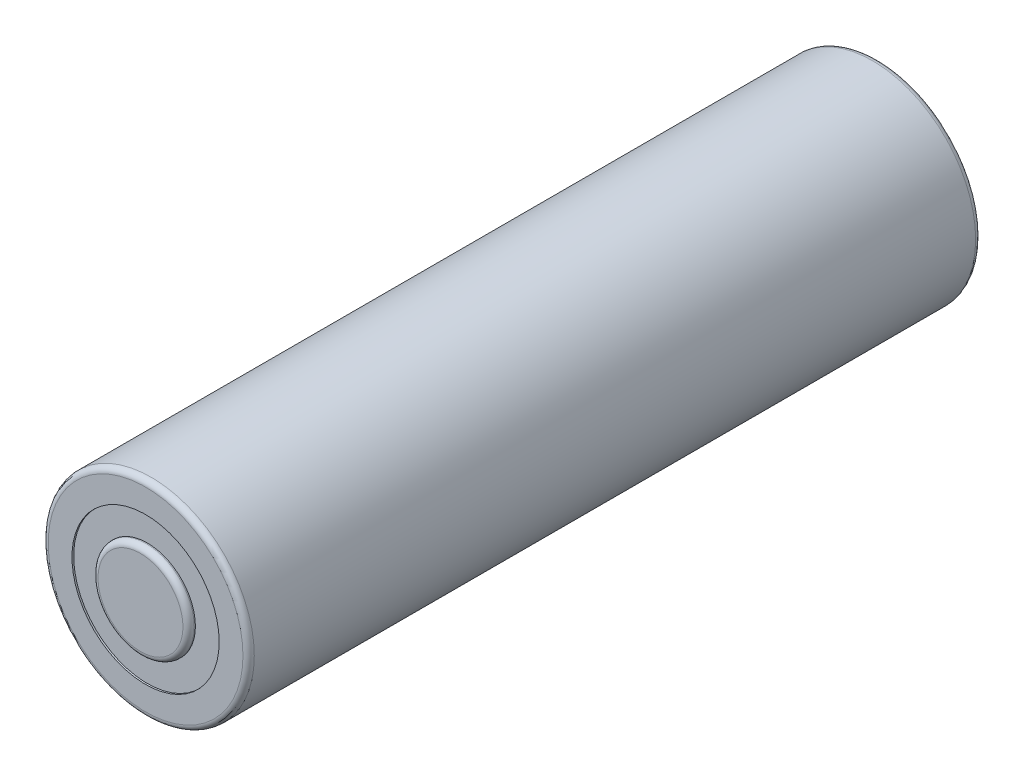
ISO-10303-21;
HEADER;
FILE_DESCRIPTION(('STEP AP214'),'2;1');
FILE_NAME('part.step','',(''),(''),'','','');
FILE_SCHEMA(('AUTOMOTIVE_DESIGN { 1 0 10303 214 1 1 1 1 }'));
ENDSEC;
DATA;
#1=APPLICATION_CONTEXT('core data for automotive mechanical design processes');
#2=APPLICATION_PROTOCOL_DEFINITION('international standard','automotive_design',2000,#1);
#3=PRODUCT_CONTEXT('',#1,'mechanical');
#4=PRODUCT('Part','Part','',(#3));
#5=PRODUCT_RELATED_PRODUCT_CATEGORY('part','',(#4));
#6=PRODUCT_DEFINITION_FORMATION('','',#4);
#7=PRODUCT_DEFINITION_CONTEXT('part definition',#1,'design');
#8=PRODUCT_DEFINITION('design','',#6,#7);
#9=PRODUCT_DEFINITION_SHAPE('','',#8);
#10=(LENGTH_UNIT() NAMED_UNIT(*) SI_UNIT(.MILLI.,.METRE.));
#11=(NAMED_UNIT(*) PLANE_ANGLE_UNIT() SI_UNIT($,.RADIAN.));
#12=(NAMED_UNIT(*) SI_UNIT($,.STERADIAN.) SOLID_ANGLE_UNIT());
#13=UNCERTAINTY_MEASURE_WITH_UNIT(LENGTH_MEASURE(1.E-05),#10,'distance_accuracy_value','');
#14=(GEOMETRIC_REPRESENTATION_CONTEXT(3) GLOBAL_UNCERTAINTY_ASSIGNED_CONTEXT((#13)) GLOBAL_UNIT_ASSIGNED_CONTEXT((#10,
#11,#12)) REPRESENTATION_CONTEXT('',''));
#15=CARTESIAN_POINT('',(0.,0.,0.));
#16=DIRECTION('',(0.,0.,1.));
#17=DIRECTION('',(1.,0.,0.));
#18=AXIS2_PLACEMENT_3D('',#15,#16,#17);
#19=CARTESIAN_POINT('',(-28.8743604465354,15.271996124031,64.7));
#20=DIRECTION('',(0.,0.,-1.));
#21=DIRECTION('',(-1.,0.,0.));
#22=AXIS2_PLACEMENT_3D('',#19,#20,#21);
#23=CYLINDRICAL_SURFACE('',#22,9.1);
#24=CARTESIAN_POINT('',(-28.8743604465354,15.271996124031,64.2));
#25=DIRECTION('',(0.,0.,1.));
#26=DIRECTION('',(1.,0.,0.));
#27=AXIS2_PLACEMENT_3D('',#24,#25,#26);
#28=CIRCLE('',#27,9.1);
#29=CARTESIAN_POINT('',(-19.7743604465354,15.271996124031,64.2));
#30=VERTEX_POINT('',#29);
#31=EDGE_CURVE('E45',#30,#30,#28,.F.);
#32=ORIENTED_EDGE('',*,*,#31,.T.);
#33=EDGE_LOOP('',(#32));
#34=FACE_BOUND('',#33,.T.);
#35=CARTESIAN_POINT('',(-28.8743604465354,15.271996124031,0.5));
#36=DIRECTION('',(0.,0.,1.));
#37=DIRECTION('',(1.,0.,0.));
#38=AXIS2_PLACEMENT_3D('',#35,#36,#37);
#39=CIRCLE('',#38,9.1);
#40=CARTESIAN_POINT('',(-19.7743604465354,15.271996124031,0.5));
#41=VERTEX_POINT('',#40);
#42=EDGE_CURVE('E57',#41,#41,#39,.T.);
#43=ORIENTED_EDGE('',*,*,#42,.T.);
#44=EDGE_LOOP('',(#43));
#45=FACE_BOUND('',#44,.T.);
#46=ADVANCED_FACE('F34',(#34,#45),#23,.T.);
#47=CARTESIAN_POINT('',(-28.8743604465354,15.271996124031,64.7));
#48=DIRECTION('',(0.,0.,1.));
#49=DIRECTION('',(1.,0.,0.));
#50=AXIS2_PLACEMENT_3D('',#47,#48,#49);
#51=PLANE('',#50);
#52=CARTESIAN_POINT('',(-28.8743604465354,15.271996124031,64.7));
#53=DIRECTION('',(0.,0.,1.));
#54=DIRECTION('',(1.,0.,0.));
#55=AXIS2_PLACEMENT_3D('',#52,#53,#54);
#56=CIRCLE('',#55,6.5);
#57=CARTESIAN_POINT('',(-22.3743604465354,15.271996124031,64.7));
#58=VERTEX_POINT('',#57);
#59=EDGE_CURVE('E64',#58,#58,#56,.T.);
#60=ORIENTED_EDGE('',*,*,#59,.F.);
#61=EDGE_LOOP('',(#60));
#62=FACE_BOUND('',#61,.T.);
#63=CARTESIAN_POINT('',(-28.8743604465354,15.271996124031,64.7));
#64=DIRECTION('',(0.,0.,1.));
#65=DIRECTION('',(1.,0.,0.));
#66=AXIS2_PLACEMENT_3D('',#63,#64,#65);
#67=CIRCLE('',#66,8.6);
#68=CARTESIAN_POINT('',(-20.2743604465354,15.271996124031,64.7));
#69=VERTEX_POINT('',#68);
#70=EDGE_CURVE('E49',#69,#69,#67,.T.);
#71=ORIENTED_EDGE('',*,*,#70,.T.);
#72=EDGE_LOOP('',(#71));
#73=FACE_BOUND('',#72,.T.);
#74=ADVANCED_FACE('F93',(#62,#73),#51,.T.);
#75=CARTESIAN_POINT('',(-28.8743604465354,15.271996124031,0.));
#76=DIRECTION('',(0.,0.,1.));
#77=DIRECTION('',(1.,0.,0.));
#78=AXIS2_PLACEMENT_3D('',#75,#76,#77);
#79=PLANE('',#78);
#80=CARTESIAN_POINT('',(-28.8743604465354,15.271996124031,0.));
#81=DIRECTION('',(0.,0.,-1.));
#82=DIRECTION('',(-1.,0.,0.));
#83=AXIS2_PLACEMENT_3D('',#80,#81,#82);
#84=CIRCLE('',#83,6.5);
#85=CARTESIAN_POINT('',(-35.3743604465354,15.271996124031,0.));
#86=VERTEX_POINT('',#85);
#87=EDGE_CURVE('E61',#86,#86,#84,.T.);
#88=ORIENTED_EDGE('',*,*,#87,.F.);
#89=EDGE_LOOP('',(#88));
#90=FACE_BOUND('',#89,.T.);
#91=CARTESIAN_POINT('',(-28.8743604465354,15.271996124031,0.));
#92=DIRECTION('',(0.,0.,1.));
#93=DIRECTION('',(1.,0.,0.));
#94=AXIS2_PLACEMENT_3D('',#91,#92,#93);
#95=CIRCLE('',#94,8.6);
#96=CARTESIAN_POINT('',(-20.2743604465354,15.271996124031,0.));
#97=VERTEX_POINT('',#96);
#98=EDGE_CURVE('E54',#97,#97,#95,.F.);
#99=ORIENTED_EDGE('',*,*,#98,.T.);
#100=EDGE_LOOP('',(#99));
#101=FACE_BOUND('',#100,.T.);
#102=ADVANCED_FACE('F99',(#90,#101),#79,.F.);
#103=CARTESIAN_POINT('',(-28.8743604465354,15.271996124031,0.5));
#104=DIRECTION('',(0.,0.,1.));
#105=DIRECTION('',(1.,0.,0.));
#106=AXIS2_PLACEMENT_3D('',#103,#104,#105);
#107=TOROIDAL_SURFACE('',#106,8.6,0.5);
#108=ORIENTED_EDGE('',*,*,#98,.F.);
#109=EDGE_LOOP('',(#108));
#110=FACE_BOUND('',#109,.T.);
#111=ORIENTED_EDGE('',*,*,#42,.F.);
#112=EDGE_LOOP('',(#111));
#113=FACE_BOUND('',#112,.T.);
#114=ADVANCED_FACE('F105',(#110,#113),#107,.T.);
#115=CARTESIAN_POINT('',(-28.8743604465354,15.271996124031,64.2));
#116=DIRECTION('',(0.,0.,1.));
#117=DIRECTION('',(1.,0.,0.));
#118=AXIS2_PLACEMENT_3D('',#115,#116,#117);
#119=TOROIDAL_SURFACE('',#118,8.6,0.5);
#120=ORIENTED_EDGE('',*,*,#31,.F.);
#121=EDGE_LOOP('',(#120));
#122=FACE_BOUND('',#121,.T.);
#123=ORIENTED_EDGE('',*,*,#70,.F.);
#124=EDGE_LOOP('',(#123));
#125=FACE_BOUND('',#124,.T.);
#126=ADVANCED_FACE('F107',(#122,#125),#119,.T.);
#127=CARTESIAN_POINT('',(-28.8743604465354,15.271996124031,0.35));
#128=DIRECTION('',(0.,0.,-1.));
#129=DIRECTION('',(-1.,0.,0.));
#130=AXIS2_PLACEMENT_3D('',#127,#128,#129);
#131=CYLINDRICAL_SURFACE('',#130,6.5);
#132=CARTESIAN_POINT('',(-28.8743604465354,15.271996124031,0.35));
#133=DIRECTION('',(0.,0.,-1.));
#134=DIRECTION('',(-1.,0.,0.));
#135=AXIS2_PLACEMENT_3D('',#132,#133,#134);
#136=CIRCLE('',#135,6.5);
#137=CARTESIAN_POINT('',(-35.3743604465354,15.271996124031,0.35));
#138=VERTEX_POINT('',#137);
#139=EDGE_CURVE('E60',#138,#138,#136,.T.);
#140=ORIENTED_EDGE('',*,*,#139,.F.);
#141=EDGE_LOOP('',(#140));
#142=FACE_BOUND('',#141,.T.);
#143=ORIENTED_EDGE('',*,*,#87,.T.);
#144=EDGE_LOOP('',(#143));
#145=FACE_BOUND('',#144,.T.);
#146=ADVANCED_FACE('F110',(#142,#145),#131,.F.);
#147=CARTESIAN_POINT('',(-28.8743604465354,15.271996124031,0.35));
#148=DIRECTION('',(0.,0.,-1.));
#149=DIRECTION('',(-1.,0.,0.));
#150=AXIS2_PLACEMENT_3D('',#147,#148,#149);
#151=PLANE('',#150);
#152=ORIENTED_EDGE('',*,*,#139,.T.);
#153=EDGE_LOOP('',(#152));
#154=FACE_BOUND('',#153,.T.);
#155=ADVANCED_FACE('F89',(#154),#151,.T.);
#156=CARTESIAN_POINT('',(-28.8743604465354,15.271996124031,64.35));
#157=DIRECTION('',(0.,0.,1.));
#158=DIRECTION('',(1.,0.,0.));
#159=AXIS2_PLACEMENT_3D('',#156,#157,#158);
#160=CYLINDRICAL_SURFACE('',#159,6.5);
#161=CARTESIAN_POINT('',(-28.8743604465354,15.271996124031,64.55));
#162=DIRECTION('',(0.,0.,1.));
#163=DIRECTION('',(1.,0.,0.));
#164=AXIS2_PLACEMENT_3D('',#161,#162,#163);
#165=CIRCLE('',#164,6.5);
#166=CARTESIAN_POINT('',(-22.3743604465354,15.271996124031,64.55));
#167=VERTEX_POINT('',#166);
#168=EDGE_CURVE('E69',#167,#167,#165,.T.);
#169=ORIENTED_EDGE('',*,*,#168,.F.);
#170=EDGE_LOOP('',(#169));
#171=FACE_BOUND('',#170,.T.);
#172=ORIENTED_EDGE('',*,*,#59,.T.);
#173=EDGE_LOOP('',(#172));
#174=FACE_BOUND('',#173,.T.);
#175=ADVANCED_FACE('F81',(#171,#174),#160,.F.);
#176=CARTESIAN_POINT('',(-28.8743604465354,15.271996124031,64.55));
#177=DIRECTION('',(0.,0.,1.));
#178=DIRECTION('',(1.,0.,0.));
#179=AXIS2_PLACEMENT_3D('',#176,#177,#178);
#180=PLANE('',#179);
#181=ORIENTED_EDGE('',*,*,#168,.T.);
#182=EDGE_LOOP('',(#181));
#183=FACE_BOUND('',#182,.T.);
#184=CARTESIAN_POINT('',(-28.8743604465354,15.271996124031,64.55));
#185=DIRECTION('',(0.,0.,1.));
#186=DIRECTION('',(1.,0.,0.));
#187=AXIS2_PLACEMENT_3D('',#184,#185,#186);
#188=CIRCLE('',#187,4.25);
#189=CARTESIAN_POINT('',(-24.6243604465354,15.271996124031,64.55));
#190=VERTEX_POINT('',#189);
#191=EDGE_CURVE('E72',#190,#190,#188,.T.);
#192=ORIENTED_EDGE('',*,*,#191,.F.);
#193=EDGE_LOOP('',(#192));
#194=FACE_BOUND('',#193,.T.);
#195=ADVANCED_FACE('F78',(#183,#194),#180,.T.);
#196=CARTESIAN_POINT('',(-28.8743604465354,15.271996124031,65.15));
#197=DIRECTION('',(0.,0.,1.));
#198=DIRECTION('',(1.,0.,0.));
#199=AXIS2_PLACEMENT_3D('',#196,#197,#198);
#200=PLANE('',#199);
#201=CARTESIAN_POINT('',(-28.8743604465354,15.271996124031,65.15));
#202=DIRECTION('',(0.,0.,1.));
#203=DIRECTION('',(1.,0.,0.));
#204=AXIS2_PLACEMENT_3D('',#201,#202,#203);
#205=CIRCLE('',#204,3.75);
#206=CARTESIAN_POINT('',(-25.1243604465354,15.271996124031,65.15));
#207=VERTEX_POINT('',#206);
#208=EDGE_CURVE('E41',#207,#207,#205,.T.);
#209=ORIENTED_EDGE('',*,*,#208,.T.);
#210=EDGE_LOOP('',(#209));
#211=FACE_BOUND('',#210,.T.);
#212=ADVANCED_FACE('F80',(#211),#200,.T.);
#213=CARTESIAN_POINT('',(-28.8743604465354,15.271996124031,64.65));
#214=DIRECTION('',(0.,0.,1.));
#215=DIRECTION('',(1.,0.,0.));
#216=AXIS2_PLACEMENT_3D('',#213,#214,#215);
#217=TOROIDAL_SURFACE('',#216,3.75,0.5);
#218=CARTESIAN_POINT('',(-28.8743604465354,15.271996124031,64.65));
#219=DIRECTION('',(0.,0.,1.));
#220=DIRECTION('',(1.,0.,0.));
#221=AXIS2_PLACEMENT_3D('',#218,#219,#220);
#222=CIRCLE('',#221,4.25);
#223=CARTESIAN_POINT('',(-24.6243604465354,15.271996124031,64.65));
#224=VERTEX_POINT('',#223);
#225=EDGE_CURVE('E10',#224,#224,#222,.F.);
#226=ORIENTED_EDGE('',*,*,#225,.F.);
#227=EDGE_LOOP('',(#226));
#228=FACE_BOUND('',#227,.T.);
#229=ORIENTED_EDGE('',*,*,#208,.F.);
#230=EDGE_LOOP('',(#229));
#231=FACE_BOUND('',#230,.T.);
#232=ADVANCED_FACE('F36',(#228,#231),#217,.T.);
#233=CARTESIAN_POINT('',(-28.8743604465354,15.271996124031,65.15));
#234=DIRECTION('',(0.,0.,-1.));
#235=DIRECTION('',(-1.,0.,0.));
#236=AXIS2_PLACEMENT_3D('',#233,#234,#235);
#237=CYLINDRICAL_SURFACE('',#236,4.25);
#238=ORIENTED_EDGE('',*,*,#191,.T.);
#239=EDGE_LOOP('',(#238));
#240=FACE_BOUND('',#239,.T.);
#241=ORIENTED_EDGE('',*,*,#225,.T.);
#242=EDGE_LOOP('',(#241));
#243=FACE_BOUND('',#242,.T.);
#244=ADVANCED_FACE('F76',(#240,#243),#237,.T.);
#245=CLOSED_SHELL('',(#46,#74,#102,#114,#126,#146,#155,#175,#195,#212,#232,#244));
#246=MANIFOLD_SOLID_BREP('B2',#245);
#247=ADVANCED_BREP_SHAPE_REPRESENTATION('',(#18,#246),#14);
#248=SHAPE_DEFINITION_REPRESENTATION(#9,#247);
ENDSEC;
END-ISO-10303-21;
